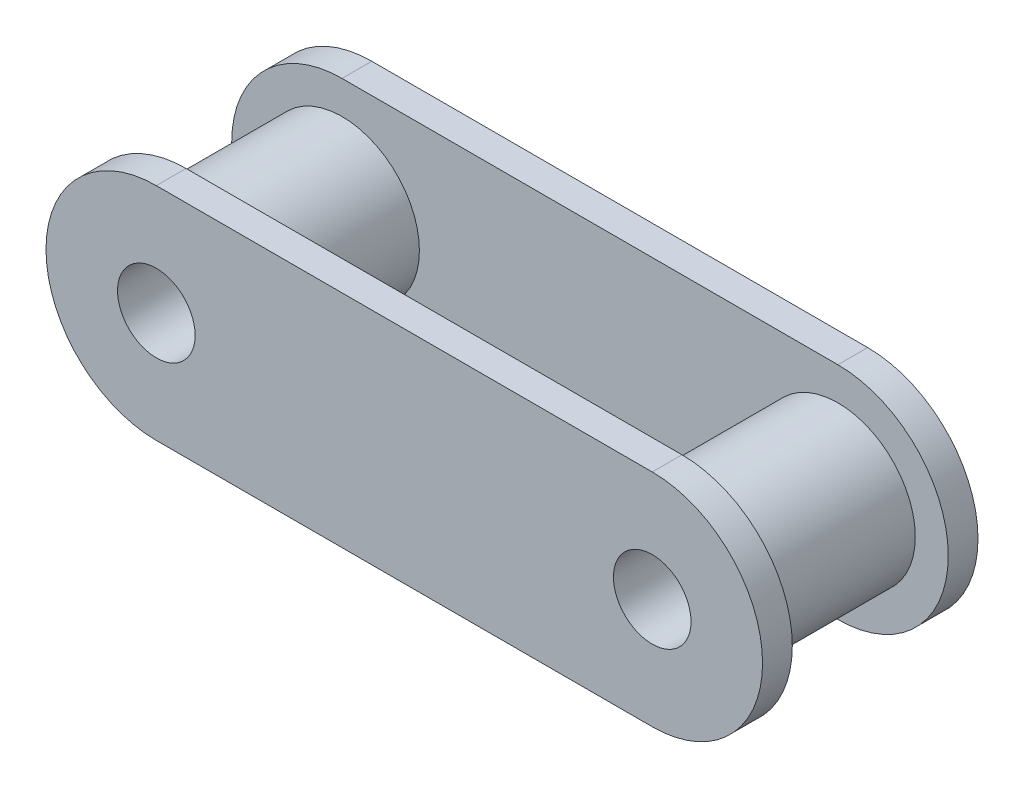
ISO-10303-21;
HEADER;
FILE_DESCRIPTION(('STEP AP214'),'2;1');
FILE_NAME('part.step','',(''),(''),'','','');
FILE_SCHEMA(('AUTOMOTIVE_DESIGN { 1 0 10303 214 1 1 1 1 }'));
ENDSEC;
DATA;
#1=APPLICATION_CONTEXT('core data for automotive mechanical design processes');
#2=APPLICATION_PROTOCOL_DEFINITION('international standard','automotive_design',2000,#1);
#3=PRODUCT_CONTEXT('',#1,'mechanical');
#4=PRODUCT('Part','Part','',(#3));
#5=PRODUCT_RELATED_PRODUCT_CATEGORY('part','',(#4));
#6=PRODUCT_DEFINITION_FORMATION('','',#4);
#7=PRODUCT_DEFINITION_CONTEXT('part definition',#1,'design');
#8=PRODUCT_DEFINITION('design','',#6,#7);
#9=PRODUCT_DEFINITION_SHAPE('','',#8);
#10=(LENGTH_UNIT() NAMED_UNIT(*) SI_UNIT(.MILLI.,.METRE.));
#11=(NAMED_UNIT(*) PLANE_ANGLE_UNIT() SI_UNIT($,.RADIAN.));
#12=(NAMED_UNIT(*) SI_UNIT($,.STERADIAN.) SOLID_ANGLE_UNIT());
#13=UNCERTAINTY_MEASURE_WITH_UNIT(LENGTH_MEASURE(1.E-05),#10,'distance_accuracy_value','');
#14=(GEOMETRIC_REPRESENTATION_CONTEXT(3) GLOBAL_UNCERTAINTY_ASSIGNED_CONTEXT((#13)) GLOBAL_UNIT_ASSIGNED_CONTEXT((#10,
#11,#12)) REPRESENTATION_CONTEXT('',''));
#15=CARTESIAN_POINT('',(0.,0.,0.));
#16=DIRECTION('',(0.,0.,1.));
#17=DIRECTION('',(1.,0.,0.));
#18=AXIS2_PLACEMENT_3D('',#15,#16,#17);
#19=CARTESIAN_POINT('',(-12.7,0.,0.));
#20=DIRECTION('',(0.,0.,1.));
#21=DIRECTION('',(1.,0.,0.));
#22=AXIS2_PLACEMENT_3D('',#19,#20,#21);
#23=PLANE('',#22);
#24=CARTESIAN_POINT('',(12.7,0.,0.));
#25=DIRECTION('',(0.,0.,1.));
#26=DIRECTION('',(1.,0.,0.));
#27=AXIS2_PLACEMENT_3D('',#24,#25,#26);
#28=CIRCLE('',#27,3.9624);
#29=CARTESIAN_POINT('',(16.6624,0.,0.));
#30=VERTEX_POINT('',#29);
#31=EDGE_CURVE('E40',#30,#30,#28,.F.);
#32=ORIENTED_EDGE('',*,*,#31,.F.);
#33=EDGE_LOOP('',(#32));
#34=FACE_BOUND('',#33,.T.);
#35=CARTESIAN_POINT('',(-12.7,0.,0.));
#36=DIRECTION('',(0.,0.,1.));
#37=DIRECTION('',(1.,0.,0.));
#38=AXIS2_PLACEMENT_3D('',#35,#36,#37);
#39=CIRCLE('',#38,5.6515);
#40=CARTESIAN_POINT('',(-12.7,5.6515,0.));
#41=VERTEX_POINT('',#40);
#42=CARTESIAN_POINT('',(-12.7,-5.6515,0.));
#43=VERTEX_POINT('',#42);
#44=EDGE_CURVE('E165',#41,#43,#39,.T.);
#45=ORIENTED_EDGE('',*,*,#44,.F.);
#46=DIRECTION('',(-1.,0.,0.));
#47=VECTOR('',#46,1.);
#48=CARTESIAN_POINT('',(-12.7,5.6515,0.));
#49=LINE('',#48,#47);
#50=CARTESIAN_POINT('',(12.7,5.6515,0.));
#51=VERTEX_POINT('',#50);
#52=EDGE_CURVE('E72',#51,#41,#49,.T.);
#53=ORIENTED_EDGE('',*,*,#52,.F.);
#54=CARTESIAN_POINT('',(12.7,0.,0.));
#55=DIRECTION('',(0.,0.,1.));
#56=DIRECTION('',(1.,0.,0.));
#57=AXIS2_PLACEMENT_3D('',#54,#55,#56);
#58=CIRCLE('',#57,5.6515);
#59=CARTESIAN_POINT('',(12.7,-5.6515,0.));
#60=VERTEX_POINT('',#59);
#61=EDGE_CURVE('E66',#60,#51,#58,.T.);
#62=ORIENTED_EDGE('',*,*,#61,.F.);
#63=DIRECTION('',(1.,0.,0.));
#64=VECTOR('',#63,1.);
#65=CARTESIAN_POINT('',(-12.7,-5.6515,0.));
#66=LINE('',#65,#64);
#67=EDGE_CURVE('E175',#43,#60,#66,.T.);
#68=ORIENTED_EDGE('',*,*,#67,.F.);
#69=EDGE_LOOP('',(#45,#53,#62,#68));
#70=FACE_BOUND('',#69,.T.);
#71=CARTESIAN_POINT('',(-12.7,0.,0.));
#72=DIRECTION('',(0.,0.,1.));
#73=DIRECTION('',(1.,0.,0.));
#74=AXIS2_PLACEMENT_3D('',#71,#72,#73);
#75=CIRCLE('',#74,3.9624);
#76=CARTESIAN_POINT('',(-8.7376,0.,0.));
#77=VERTEX_POINT('',#76);
#78=EDGE_CURVE('E11',#77,#77,#75,.F.);
#79=ORIENTED_EDGE('',*,*,#78,.F.);
#80=EDGE_LOOP('',(#79));
#81=FACE_BOUND('',#80,.T.);
#82=ADVANCED_FACE('F31',(#34,#70,#81),#23,.F.);
#83=CARTESIAN_POINT('',(-12.7,0.,1.524));
#84=DIRECTION('',(0.,0.,1.));
#85=DIRECTION('',(1.,0.,0.));
#86=AXIS2_PLACEMENT_3D('',#83,#84,#85);
#87=PLANE('',#86);
#88=CARTESIAN_POINT('',(-12.7,0.,1.524));
#89=DIRECTION('',(0.,0.,1.));
#90=DIRECTION('',(1.,0.,0.));
#91=AXIS2_PLACEMENT_3D('',#88,#89,#90);
#92=CIRCLE('',#91,1.98755);
#93=CARTESIAN_POINT('',(-10.71245,0.,1.524));
#94=VERTEX_POINT('',#93);
#95=EDGE_CURVE('E162',#94,#94,#92,.T.);
#96=ORIENTED_EDGE('',*,*,#95,.F.);
#97=EDGE_LOOP('',(#96));
#98=FACE_BOUND('',#97,.T.);
#99=CARTESIAN_POINT('',(-12.7,0.,1.524));
#100=DIRECTION('',(0.,0.,1.));
#101=DIRECTION('',(1.,0.,0.));
#102=AXIS2_PLACEMENT_3D('',#99,#100,#101);
#103=CIRCLE('',#102,5.6515);
#104=CARTESIAN_POINT('',(-12.7,5.6515,1.524));
#105=VERTEX_POINT('',#104);
#106=CARTESIAN_POINT('',(-12.7,-5.6515,1.524));
#107=VERTEX_POINT('',#106);
#108=EDGE_CURVE('E166',#105,#107,#103,.T.);
#109=ORIENTED_EDGE('',*,*,#108,.T.);
#110=DIRECTION('',(1.,0.,0.));
#111=VECTOR('',#110,1.);
#112=CARTESIAN_POINT('',(-12.7,-5.6515,1.524));
#113=LINE('',#112,#111);
#114=CARTESIAN_POINT('',(12.7,-5.6515,1.524));
#115=VERTEX_POINT('',#114);
#116=EDGE_CURVE('E80',#107,#115,#113,.T.);
#117=ORIENTED_EDGE('',*,*,#116,.T.);
#118=CARTESIAN_POINT('',(12.7,0.,1.524));
#119=DIRECTION('',(0.,0.,1.));
#120=DIRECTION('',(1.,0.,0.));
#121=AXIS2_PLACEMENT_3D('',#118,#119,#120);
#122=CIRCLE('',#121,5.6515);
#123=CARTESIAN_POINT('',(12.7,5.6515,1.524));
#124=VERTEX_POINT('',#123);
#125=EDGE_CURVE('E169',#115,#124,#122,.T.);
#126=ORIENTED_EDGE('',*,*,#125,.T.);
#127=DIRECTION('',(-1.,0.,0.));
#128=VECTOR('',#127,1.);
#129=CARTESIAN_POINT('',(-12.7,5.6515,1.524));
#130=LINE('',#129,#128);
#131=EDGE_CURVE('E48',#124,#105,#130,.T.);
#132=ORIENTED_EDGE('',*,*,#131,.T.);
#133=EDGE_LOOP('',(#109,#117,#126,#132));
#134=FACE_BOUND('',#133,.T.);
#135=CARTESIAN_POINT('',(12.7,0.,1.524));
#136=DIRECTION('',(0.,0.,1.));
#137=DIRECTION('',(1.,0.,0.));
#138=AXIS2_PLACEMENT_3D('',#135,#136,#137);
#139=CIRCLE('',#138,1.98755);
#140=CARTESIAN_POINT('',(14.68755,0.,1.524));
#141=VERTEX_POINT('',#140);
#142=EDGE_CURVE('E159',#141,#141,#139,.T.);
#143=ORIENTED_EDGE('',*,*,#142,.F.);
#144=EDGE_LOOP('',(#143));
#145=FACE_BOUND('',#144,.T.);
#146=ADVANCED_FACE('F193',(#98,#134,#145),#87,.T.);
#147=CARTESIAN_POINT('',(-12.7,0.,1.524));
#148=DIRECTION('',(0.,0.,-1.));
#149=DIRECTION('',(-1.,0.,0.));
#150=AXIS2_PLACEMENT_3D('',#147,#148,#149);
#151=CYLINDRICAL_SURFACE('',#150,5.6515);
#152=ORIENTED_EDGE('',*,*,#44,.T.);
#153=DIRECTION('',(0.,0.,-1.));
#154=VECTOR('',#153,1.);
#155=CARTESIAN_POINT('',(-12.7,-5.6515,1.524));
#156=LINE('',#155,#154);
#157=EDGE_CURVE('E184',#107,#43,#156,.T.);
#158=ORIENTED_EDGE('',*,*,#157,.F.);
#159=ORIENTED_EDGE('',*,*,#108,.F.);
#160=DIRECTION('',(0.,0.,-1.));
#161=VECTOR('',#160,1.);
#162=CARTESIAN_POINT('',(-12.7,5.6515,1.524));
#163=LINE('',#162,#161);
#164=EDGE_CURVE('E172',#105,#41,#163,.T.);
#165=ORIENTED_EDGE('',*,*,#164,.T.);
#166=EDGE_LOOP('',(#152,#158,#159,#165));
#167=FACE_BOUND('',#166,.T.);
#168=ADVANCED_FACE('F33',(#167),#151,.T.);
#169=CARTESIAN_POINT('',(-12.7,-5.6515,1.524));
#170=DIRECTION('',(0.,1.,0.));
#171=DIRECTION('',(0.,0.,1.));
#172=AXIS2_PLACEMENT_3D('',#169,#170,#171);
#173=PLANE('',#172);
#174=ORIENTED_EDGE('',*,*,#67,.T.);
#175=DIRECTION('',(0.,0.,-1.));
#176=VECTOR('',#175,1.);
#177=CARTESIAN_POINT('',(12.7,-5.6515,1.524));
#178=LINE('',#177,#176);
#179=EDGE_CURVE('E182',#115,#60,#178,.T.);
#180=ORIENTED_EDGE('',*,*,#179,.F.);
#181=ORIENTED_EDGE('',*,*,#116,.F.);
#182=ORIENTED_EDGE('',*,*,#157,.T.);
#183=EDGE_LOOP('',(#174,#180,#181,#182));
#184=FACE_BOUND('',#183,.T.);
#185=ADVANCED_FACE('F246',(#184),#173,.F.);
#186=CARTESIAN_POINT('',(12.7,0.,1.524));
#187=DIRECTION('',(0.,0.,-1.));
#188=DIRECTION('',(-1.,0.,0.));
#189=AXIS2_PLACEMENT_3D('',#186,#187,#188);
#190=CYLINDRICAL_SURFACE('',#189,5.6515);
#191=ORIENTED_EDGE('',*,*,#61,.T.);
#192=DIRECTION('',(0.,0.,-1.));
#193=VECTOR('',#192,1.);
#194=CARTESIAN_POINT('',(12.7,5.6515,1.524));
#195=LINE('',#194,#193);
#196=EDGE_CURVE('E180',#124,#51,#195,.T.);
#197=ORIENTED_EDGE('',*,*,#196,.F.);
#198=ORIENTED_EDGE('',*,*,#125,.F.);
#199=ORIENTED_EDGE('',*,*,#179,.T.);
#200=EDGE_LOOP('',(#191,#197,#198,#199));
#201=FACE_BOUND('',#200,.T.);
#202=ADVANCED_FACE('F244',(#201),#190,.T.);
#203=CARTESIAN_POINT('',(-12.7,5.6515,1.524));
#204=DIRECTION('',(0.,-1.,0.));
#205=DIRECTION('',(0.,0.,-1.));
#206=AXIS2_PLACEMENT_3D('',#203,#204,#205);
#207=PLANE('',#206);
#208=ORIENTED_EDGE('',*,*,#52,.T.);
#209=ORIENTED_EDGE('',*,*,#164,.F.);
#210=ORIENTED_EDGE('',*,*,#131,.F.);
#211=ORIENTED_EDGE('',*,*,#196,.T.);
#212=EDGE_LOOP('',(#208,#209,#210,#211));
#213=FACE_BOUND('',#212,.T.);
#214=ADVANCED_FACE('F237',(#213),#207,.F.);
#215=CARTESIAN_POINT('',(-12.7,0.,1.524));
#216=DIRECTION('',(0.,0.,-1.));
#217=DIRECTION('',(-1.,0.,0.));
#218=AXIS2_PLACEMENT_3D('',#215,#216,#217);
#219=CYLINDRICAL_SURFACE('',#218,1.98755);
#220=ORIENTED_EDGE('',*,*,#95,.T.);
#221=EDGE_LOOP('',(#220));
#222=FACE_BOUND('',#221,.T.);
#223=CARTESIAN_POINT('',(-12.7,0.,-9.5123));
#224=DIRECTION('',(0.,0.,1.));
#225=DIRECTION('',(1.,0.,0.));
#226=AXIS2_PLACEMENT_3D('',#223,#224,#225);
#227=CIRCLE('',#226,1.98755);
#228=CARTESIAN_POINT('',(-10.71245,0.,-9.5123));
#229=VERTEX_POINT('',#228);
#230=EDGE_CURVE('E139',#229,#229,#227,.T.);
#231=ORIENTED_EDGE('',*,*,#230,.F.);
#232=EDGE_LOOP('',(#231));
#233=FACE_BOUND('',#232,.T.);
#234=ADVANCED_FACE('F233',(#222,#233),#219,.F.);
#235=CARTESIAN_POINT('',(12.7,0.,1.524));
#236=DIRECTION('',(0.,0.,-1.));
#237=DIRECTION('',(-1.,0.,0.));
#238=AXIS2_PLACEMENT_3D('',#235,#236,#237);
#239=CYLINDRICAL_SURFACE('',#238,1.98755);
#240=ORIENTED_EDGE('',*,*,#142,.T.);
#241=EDGE_LOOP('',(#240));
#242=FACE_BOUND('',#241,.T.);
#243=CARTESIAN_POINT('',(12.7,0.,-9.5123));
#244=DIRECTION('',(0.,0.,1.));
#245=DIRECTION('',(1.,0.,0.));
#246=AXIS2_PLACEMENT_3D('',#243,#244,#245);
#247=CIRCLE('',#246,1.98755);
#248=CARTESIAN_POINT('',(14.68755,0.,-9.5123));
#249=VERTEX_POINT('',#248);
#250=EDGE_CURVE('E260',#249,#249,#247,.T.);
#251=ORIENTED_EDGE('',*,*,#250,.F.);
#252=EDGE_LOOP('',(#251));
#253=FACE_BOUND('',#252,.T.);
#254=ADVANCED_FACE('F230',(#242,#253),#239,.F.);
#255=CARTESIAN_POINT('',(12.7,0.,-15.2015096390943));
#256=DIRECTION('',(0.,0.,1.));
#257=DIRECTION('',(1.,0.,0.));
#258=AXIS2_PLACEMENT_3D('',#255,#256,#257);
#259=CYLINDRICAL_SURFACE('',#258,3.9624);
#260=ORIENTED_EDGE('',*,*,#31,.T.);
#261=EDGE_LOOP('',(#260));
#262=FACE_BOUND('',#261,.T.);
#263=CARTESIAN_POINT('',(12.7,0.,-7.9883));
#264=DIRECTION('',(0.,0.,1.));
#265=DIRECTION('',(1.,0.,0.));
#266=AXIS2_PLACEMENT_3D('',#263,#264,#265);
#267=CIRCLE('',#266,3.9624);
#268=CARTESIAN_POINT('',(16.6624,0.,-7.9883));
#269=VERTEX_POINT('',#268);
#270=EDGE_CURVE('E118',#269,#269,#267,.F.);
#271=ORIENTED_EDGE('',*,*,#270,.F.);
#272=EDGE_LOOP('',(#271));
#273=FACE_BOUND('',#272,.T.);
#274=ADVANCED_FACE('F188',(#262,#273),#259,.T.);
#275=CARTESIAN_POINT('',(-12.7,0.,-15.2015096390943));
#276=DIRECTION('',(0.,0.,1.));
#277=DIRECTION('',(1.,0.,0.));
#278=AXIS2_PLACEMENT_3D('',#275,#276,#277);
#279=CYLINDRICAL_SURFACE('',#278,3.9624);
#280=ORIENTED_EDGE('',*,*,#78,.T.);
#281=EDGE_LOOP('',(#280));
#282=FACE_BOUND('',#281,.T.);
#283=CARTESIAN_POINT('',(-12.7,0.,-7.9883));
#284=DIRECTION('',(0.,0.,1.));
#285=DIRECTION('',(1.,0.,0.));
#286=AXIS2_PLACEMENT_3D('',#283,#284,#285);
#287=CIRCLE('',#286,3.9624);
#288=CARTESIAN_POINT('',(-8.7376,0.,-7.9883));
#289=VERTEX_POINT('',#288);
#290=EDGE_CURVE('E156',#289,#289,#287,.F.);
#291=ORIENTED_EDGE('',*,*,#290,.F.);
#292=EDGE_LOOP('',(#291));
#293=FACE_BOUND('',#292,.T.);
#294=ADVANCED_FACE('F199',(#282,#293),#279,.T.);
#295=CARTESIAN_POINT('',(-12.7,0.,-7.9883));
#296=DIRECTION('',(0.,0.,-1.));
#297=DIRECTION('',(1.,0.,0.));
#298=AXIS2_PLACEMENT_3D('',#295,#296,#297);
#299=PLANE('',#298);
#300=ORIENTED_EDGE('',*,*,#270,.T.);
#301=EDGE_LOOP('',(#300));
#302=FACE_BOUND('',#301,.T.);
#303=CARTESIAN_POINT('',(-12.7,0.,-7.9883));
#304=DIRECTION('',(0.,0.,1.));
#305=DIRECTION('',(1.,0.,0.));
#306=AXIS2_PLACEMENT_3D('',#303,#304,#305);
#307=CIRCLE('',#306,5.6515);
#308=CARTESIAN_POINT('',(-12.7,5.6515,-7.9883));
#309=VERTEX_POINT('',#308);
#310=CARTESIAN_POINT('',(-12.7,-5.6515,-7.9883));
#311=VERTEX_POINT('',#310);
#312=EDGE_CURVE('E145',#309,#311,#307,.T.);
#313=ORIENTED_EDGE('',*,*,#312,.T.);
#314=DIRECTION('',(1.,0.,0.));
#315=VECTOR('',#314,1.);
#316=CARTESIAN_POINT('',(-12.7,-5.6515,-7.9883));
#317=LINE('',#316,#315);
#318=CARTESIAN_POINT('',(12.7,-5.6515,-7.9883));
#319=VERTEX_POINT('',#318);
#320=EDGE_CURVE('E113',#311,#319,#317,.T.);
#321=ORIENTED_EDGE('',*,*,#320,.T.);
#322=CARTESIAN_POINT('',(12.7,0.,-7.9883));
#323=DIRECTION('',(0.,0.,1.));
#324=DIRECTION('',(1.,0.,0.));
#325=AXIS2_PLACEMENT_3D('',#322,#323,#324);
#326=CIRCLE('',#325,5.6515);
#327=CARTESIAN_POINT('',(12.7,5.6515,-7.9883));
#328=VERTEX_POINT('',#327);
#329=EDGE_CURVE('E136',#319,#328,#326,.T.);
#330=ORIENTED_EDGE('',*,*,#329,.T.);
#331=DIRECTION('',(-1.,0.,0.));
#332=VECTOR('',#331,1.);
#333=CARTESIAN_POINT('',(-12.7,5.6515,-7.9883));
#334=LINE('',#333,#332);
#335=EDGE_CURVE('E133',#328,#309,#334,.T.);
#336=ORIENTED_EDGE('',*,*,#335,.T.);
#337=EDGE_LOOP('',(#313,#321,#330,#336));
#338=FACE_BOUND('',#337,.T.);
#339=ORIENTED_EDGE('',*,*,#290,.T.);
#340=EDGE_LOOP('',(#339));
#341=FACE_BOUND('',#340,.T.);
#342=ADVANCED_FACE('F202',(#302,#338,#341),#299,.F.);
#343=CARTESIAN_POINT('',(-12.7,0.,-9.5123));
#344=DIRECTION('',(0.,0.,-1.));
#345=DIRECTION('',(1.,0.,0.));
#346=AXIS2_PLACEMENT_3D('',#343,#344,#345);
#347=PLANE('',#346);
#348=ORIENTED_EDGE('',*,*,#230,.T.);
#349=EDGE_LOOP('',(#348));
#350=FACE_BOUND('',#349,.T.);
#351=CARTESIAN_POINT('',(-12.7,0.,-9.5123));
#352=DIRECTION('',(0.,0.,1.));
#353=DIRECTION('',(1.,0.,0.));
#354=AXIS2_PLACEMENT_3D('',#351,#352,#353);
#355=CIRCLE('',#354,5.6515);
#356=CARTESIAN_POINT('',(-12.7,5.6515,-9.5123));
#357=VERTEX_POINT('',#356);
#358=CARTESIAN_POINT('',(-12.7,-5.6515,-9.5123));
#359=VERTEX_POINT('',#358);
#360=EDGE_CURVE('E126',#357,#359,#355,.T.);
#361=ORIENTED_EDGE('',*,*,#360,.F.);
#362=DIRECTION('',(-1.,0.,0.));
#363=VECTOR('',#362,1.);
#364=CARTESIAN_POINT('',(-12.7,5.6515,-9.5123));
#365=LINE('',#364,#363);
#366=CARTESIAN_POINT('',(12.7,5.6515,-9.5123));
#367=VERTEX_POINT('',#366);
#368=EDGE_CURVE('E143',#367,#357,#365,.T.);
#369=ORIENTED_EDGE('',*,*,#368,.F.);
#370=CARTESIAN_POINT('',(12.7,0.,-9.5123));
#371=DIRECTION('',(0.,0.,1.));
#372=DIRECTION('',(1.,0.,0.));
#373=AXIS2_PLACEMENT_3D('',#370,#371,#372);
#374=CIRCLE('',#373,5.6515);
#375=CARTESIAN_POINT('',(12.7,-5.6515,-9.5123));
#376=VERTEX_POINT('',#375);
#377=EDGE_CURVE('E128',#376,#367,#374,.T.);
#378=ORIENTED_EDGE('',*,*,#377,.F.);
#379=DIRECTION('',(1.,0.,0.));
#380=VECTOR('',#379,1.);
#381=CARTESIAN_POINT('',(-12.7,-5.6515,-9.5123));
#382=LINE('',#381,#380);
#383=EDGE_CURVE('E110',#359,#376,#382,.T.);
#384=ORIENTED_EDGE('',*,*,#383,.F.);
#385=EDGE_LOOP('',(#361,#369,#378,#384));
#386=FACE_BOUND('',#385,.T.);
#387=ORIENTED_EDGE('',*,*,#250,.T.);
#388=EDGE_LOOP('',(#387));
#389=FACE_BOUND('',#388,.T.);
#390=ADVANCED_FACE('F123',(#350,#386,#389),#347,.T.);
#391=CARTESIAN_POINT('',(-12.7,0.,-9.5123));
#392=DIRECTION('',(0.,0.,1.));
#393=DIRECTION('',(-1.,0.,0.));
#394=AXIS2_PLACEMENT_3D('',#391,#392,#393);
#395=CYLINDRICAL_SURFACE('',#394,5.6515);
#396=ORIENTED_EDGE('',*,*,#312,.F.);
#397=DIRECTION('',(0.,0.,1.));
#398=VECTOR('',#397,1.);
#399=CARTESIAN_POINT('',(-12.7,5.6515,-9.5123));
#400=LINE('',#399,#398);
#401=EDGE_CURVE('E131',#357,#309,#400,.T.);
#402=ORIENTED_EDGE('',*,*,#401,.F.);
#403=ORIENTED_EDGE('',*,*,#360,.T.);
#404=DIRECTION('',(0.,0.,1.));
#405=VECTOR('',#404,1.);
#406=CARTESIAN_POINT('',(-12.7,-5.6515,-9.5123));
#407=LINE('',#406,#405);
#408=EDGE_CURVE('E107',#359,#311,#407,.T.);
#409=ORIENTED_EDGE('',*,*,#408,.T.);
#410=EDGE_LOOP('',(#396,#402,#403,#409));
#411=FACE_BOUND('',#410,.T.);
#412=ADVANCED_FACE('F130',(#411),#395,.T.);
#413=CARTESIAN_POINT('',(-12.7,-5.6515,-9.5123));
#414=DIRECTION('',(0.,1.,0.));
#415=DIRECTION('',(0.,0.,-1.));
#416=AXIS2_PLACEMENT_3D('',#413,#414,#415);
#417=PLANE('',#416);
#418=ORIENTED_EDGE('',*,*,#320,.F.);
#419=ORIENTED_EDGE('',*,*,#408,.F.);
#420=ORIENTED_EDGE('',*,*,#383,.T.);
#421=DIRECTION('',(0.,0.,1.));
#422=VECTOR('',#421,1.);
#423=CARTESIAN_POINT('',(12.7,-5.6515,-9.5123));
#424=LINE('',#423,#422);
#425=EDGE_CURVE('E119',#376,#319,#424,.T.);
#426=ORIENTED_EDGE('',*,*,#425,.T.);
#427=EDGE_LOOP('',(#418,#419,#420,#426));
#428=FACE_BOUND('',#427,.T.);
#429=ADVANCED_FACE('F109',(#428),#417,.F.);
#430=CARTESIAN_POINT('',(12.7,0.,-9.5123));
#431=DIRECTION('',(0.,0.,1.));
#432=DIRECTION('',(-1.,0.,0.));
#433=AXIS2_PLACEMENT_3D('',#430,#431,#432);
#434=CYLINDRICAL_SURFACE('',#433,5.6515);
#435=ORIENTED_EDGE('',*,*,#329,.F.);
#436=ORIENTED_EDGE('',*,*,#425,.F.);
#437=ORIENTED_EDGE('',*,*,#377,.T.);
#438=DIRECTION('',(0.,0.,1.));
#439=VECTOR('',#438,1.);
#440=CARTESIAN_POINT('',(12.7,5.6515,-9.5123));
#441=LINE('',#440,#439);
#442=EDGE_CURVE('E151',#367,#328,#441,.T.);
#443=ORIENTED_EDGE('',*,*,#442,.T.);
#444=EDGE_LOOP('',(#435,#436,#437,#443));
#445=FACE_BOUND('',#444,.T.);
#446=ADVANCED_FACE('F219',(#445),#434,.T.);
#447=CARTESIAN_POINT('',(-12.7,5.6515,-9.5123));
#448=DIRECTION('',(0.,-1.,0.));
#449=DIRECTION('',(0.,0.,1.));
#450=AXIS2_PLACEMENT_3D('',#447,#448,#449);
#451=PLANE('',#450);
#452=ORIENTED_EDGE('',*,*,#335,.F.);
#453=ORIENTED_EDGE('',*,*,#442,.F.);
#454=ORIENTED_EDGE('',*,*,#368,.T.);
#455=ORIENTED_EDGE('',*,*,#401,.T.);
#456=EDGE_LOOP('',(#452,#453,#454,#455));
#457=FACE_BOUND('',#456,.T.);
#458=ADVANCED_FACE('F216',(#457),#451,.F.);
#459=CLOSED_SHELL('',(#82,#146,#168,#185,#202,#214,#234,#254,#274,#294,#342,#390,#412,#429,#446,#458));
#460=MANIFOLD_SOLID_BREP('B2',#459);
#461=ADVANCED_BREP_SHAPE_REPRESENTATION('',(#18,#460),#14);
#462=SHAPE_DEFINITION_REPRESENTATION(#9,#461);
ENDSEC;
END-ISO-10303-21;
